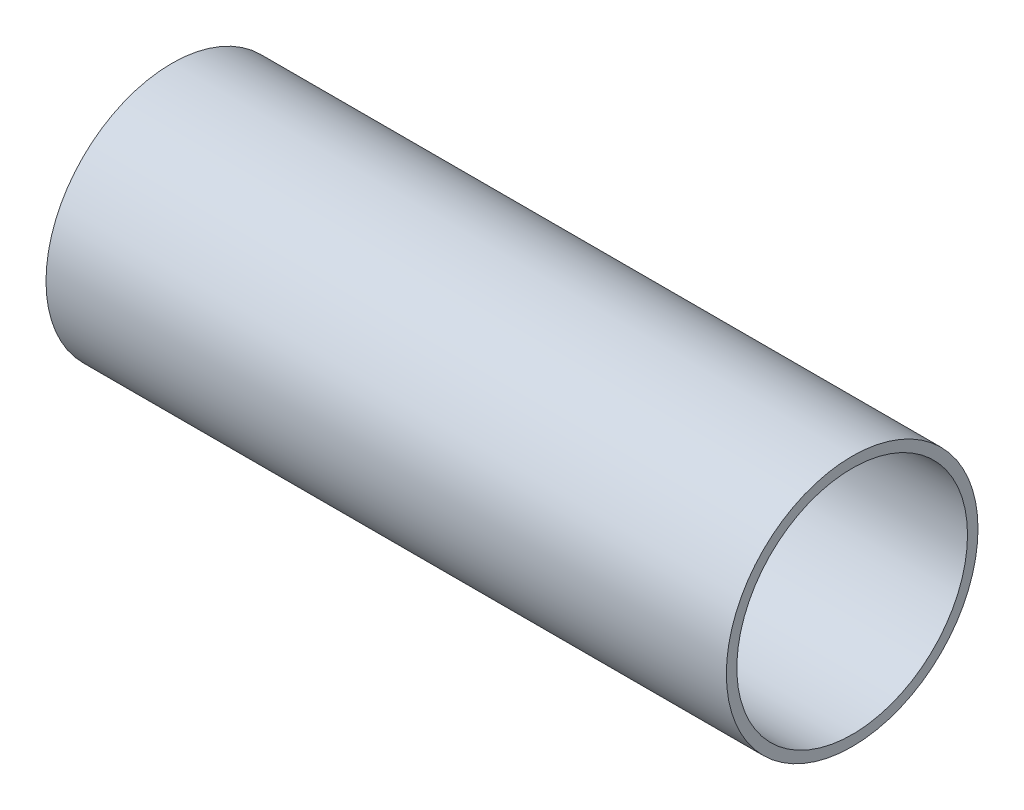
ISO-10303-21;
HEADER;
FILE_DESCRIPTION(('STEP AP214'),'2;1');
FILE_NAME('part.step','',(''),(''),'','','');
FILE_SCHEMA(('AUTOMOTIVE_DESIGN { 1 0 10303 214 1 1 1 1 }'));
ENDSEC;
DATA;
#1=APPLICATION_CONTEXT('core data for automotive mechanical design processes');
#2=APPLICATION_PROTOCOL_DEFINITION('international standard','automotive_design',2000,#1);
#3=PRODUCT_CONTEXT('',#1,'mechanical');
#4=PRODUCT('Part','Part','',(#3));
#5=PRODUCT_RELATED_PRODUCT_CATEGORY('part','',(#4));
#6=PRODUCT_DEFINITION_FORMATION('','',#4);
#7=PRODUCT_DEFINITION_CONTEXT('part definition',#1,'design');
#8=PRODUCT_DEFINITION('design','',#6,#7);
#9=PRODUCT_DEFINITION_SHAPE('','',#8);
#10=(LENGTH_UNIT() NAMED_UNIT(*) SI_UNIT(.MILLI.,.METRE.));
#11=(NAMED_UNIT(*) PLANE_ANGLE_UNIT() SI_UNIT($,.RADIAN.));
#12=(NAMED_UNIT(*) SI_UNIT($,.STERADIAN.) SOLID_ANGLE_UNIT());
#13=UNCERTAINTY_MEASURE_WITH_UNIT(LENGTH_MEASURE(1.E-05),#10,'distance_accuracy_value','');
#14=(GEOMETRIC_REPRESENTATION_CONTEXT(3) GLOBAL_UNCERTAINTY_ASSIGNED_CONTEXT((#13)) GLOBAL_UNIT_ASSIGNED_CONTEXT((#10,
#11,#12)) REPRESENTATION_CONTEXT('',''));
#15=CARTESIAN_POINT('',(0.,0.,0.));
#16=DIRECTION('',(0.,0.,1.));
#17=DIRECTION('',(1.,0.,0.));
#18=AXIS2_PLACEMENT_3D('',#15,#16,#17);
#19=CARTESIAN_POINT('',(206.,0.,0.));
#20=DIRECTION('',(1.,0.,0.));
#21=DIRECTION('',(0.,0.,-1.));
#22=AXIS2_PLACEMENT_3D('',#19,#20,#21);
#23=PLANE('',#22);
#24=CARTESIAN_POINT('',(206.,0.,0.));
#25=DIRECTION('',(1.,0.,0.));
#26=DIRECTION('',(0.,0.,-1.));
#27=AXIS2_PLACEMENT_3D('',#24,#25,#26);
#28=CIRCLE('',#27,76.2);
#29=CARTESIAN_POINT('',(206.,0.,-76.2));
#30=VERTEX_POINT('',#29);
#31=EDGE_CURVE('E10',#30,#30,#28,.T.);
#32=ORIENTED_EDGE('',*,*,#31,.T.);
#33=EDGE_LOOP('',(#32));
#34=FACE_BOUND('',#33,.T.);
#35=CARTESIAN_POINT('',(206.,0.,0.));
#36=DIRECTION('',(1.,0.,0.));
#37=DIRECTION('',(0.,0.,-1.));
#38=AXIS2_PLACEMENT_3D('',#35,#36,#37);
#39=CIRCLE('',#38,69.85);
#40=CARTESIAN_POINT('',(206.,0.,-69.85));
#41=VERTEX_POINT('',#40);
#42=EDGE_CURVE('E43',#41,#41,#39,.T.);
#43=ORIENTED_EDGE('',*,*,#42,.F.);
#44=EDGE_LOOP('',(#43));
#45=FACE_BOUND('',#44,.T.);
#46=ADVANCED_FACE('F32',(#34,#45),#23,.T.);
#47=CARTESIAN_POINT('',(-206.,0.,0.));
#48=DIRECTION('',(1.,0.,0.));
#49=DIRECTION('',(0.,0.,-1.));
#50=AXIS2_PLACEMENT_3D('',#47,#48,#49);
#51=PLANE('',#50);
#52=CARTESIAN_POINT('',(-206.,0.,0.));
#53=DIRECTION('',(1.,0.,0.));
#54=DIRECTION('',(0.,0.,-1.));
#55=AXIS2_PLACEMENT_3D('',#52,#53,#54);
#56=CIRCLE('',#55,76.2);
#57=CARTESIAN_POINT('',(-206.,0.,-76.2));
#58=VERTEX_POINT('',#57);
#59=EDGE_CURVE('E36',#58,#58,#56,.T.);
#60=ORIENTED_EDGE('',*,*,#59,.F.);
#61=EDGE_LOOP('',(#60));
#62=FACE_BOUND('',#61,.T.);
#63=CARTESIAN_POINT('',(-206.,0.,0.));
#64=DIRECTION('',(1.,0.,0.));
#65=DIRECTION('',(0.,0.,-1.));
#66=AXIS2_PLACEMENT_3D('',#63,#64,#65);
#67=CIRCLE('',#66,69.85);
#68=CARTESIAN_POINT('',(-206.,0.,-69.85));
#69=VERTEX_POINT('',#68);
#70=EDGE_CURVE('E45',#69,#69,#67,.T.);
#71=ORIENTED_EDGE('',*,*,#70,.T.);
#72=EDGE_LOOP('',(#71));
#73=FACE_BOUND('',#72,.T.);
#74=ADVANCED_FACE('F55',(#62,#73),#51,.F.);
#75=CARTESIAN_POINT('',(206.,0.,0.));
#76=DIRECTION('',(-1.,0.,0.));
#77=DIRECTION('',(0.,0.,1.));
#78=AXIS2_PLACEMENT_3D('',#75,#76,#77);
#79=CYLINDRICAL_SURFACE('',#78,76.2);
#80=ORIENTED_EDGE('',*,*,#31,.F.);
#81=EDGE_LOOP('',(#80));
#82=FACE_BOUND('',#81,.T.);
#83=ORIENTED_EDGE('',*,*,#59,.T.);
#84=EDGE_LOOP('',(#83));
#85=FACE_BOUND('',#84,.T.);
#86=ADVANCED_FACE('F34',(#82,#85),#79,.T.);
#87=CARTESIAN_POINT('',(206.,0.,0.));
#88=DIRECTION('',(-1.,0.,0.));
#89=DIRECTION('',(0.,0.,1.));
#90=AXIS2_PLACEMENT_3D('',#87,#88,#89);
#91=CYLINDRICAL_SURFACE('',#90,69.85);
#92=ORIENTED_EDGE('',*,*,#42,.T.);
#93=EDGE_LOOP('',(#92));
#94=FACE_BOUND('',#93,.T.);
#95=ORIENTED_EDGE('',*,*,#70,.F.);
#96=EDGE_LOOP('',(#95));
#97=FACE_BOUND('',#96,.T.);
#98=ADVANCED_FACE('F51',(#94,#97),#91,.F.);
#99=CLOSED_SHELL('',(#46,#74,#86,#98));
#100=MANIFOLD_SOLID_BREP('B2',#99);
#101=ADVANCED_BREP_SHAPE_REPRESENTATION('',(#18,#100),#14);
#102=SHAPE_DEFINITION_REPRESENTATION(#9,#101);
ENDSEC;
END-ISO-10303-21;
